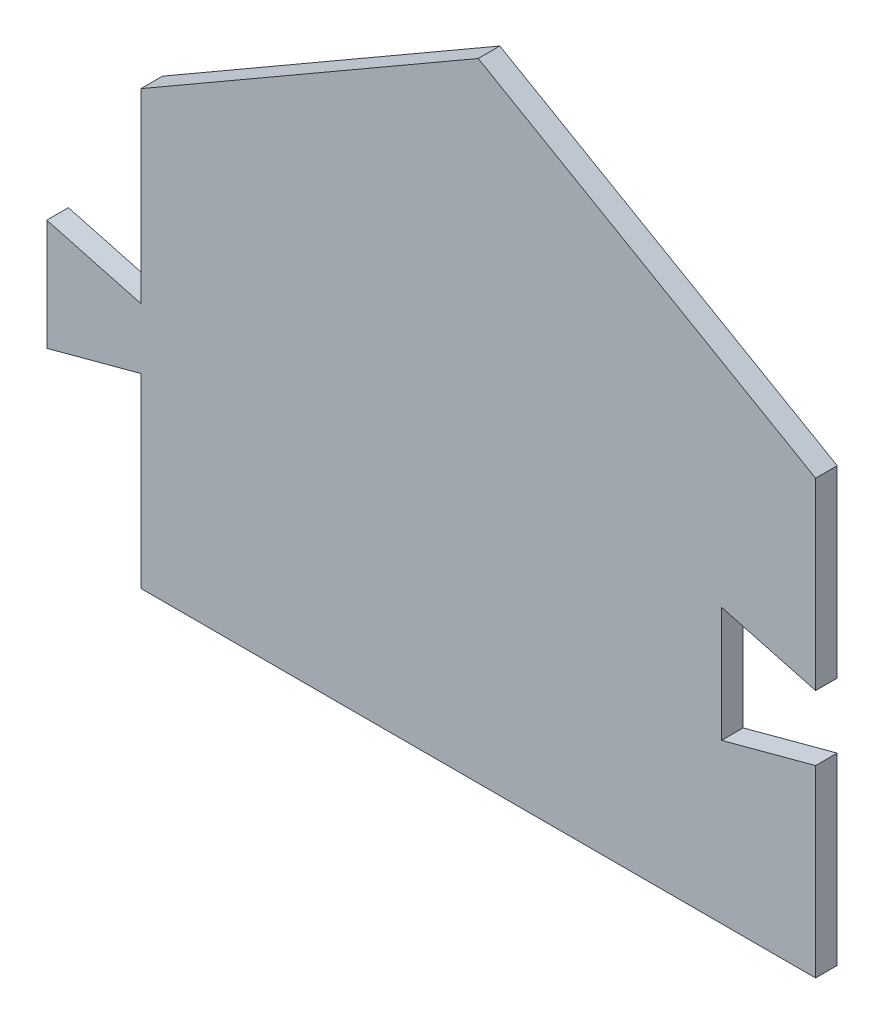
ISO-10303-21;
HEADER;
FILE_DESCRIPTION(('STEP AP214'),'2;1');
FILE_NAME('part.step','',(''),(''),'','','');
FILE_SCHEMA(('AUTOMOTIVE_DESIGN { 1 0 10303 214 1 1 1 1 }'));
ENDSEC;
DATA;
#1=APPLICATION_CONTEXT('core data for automotive mechanical design processes');
#2=APPLICATION_PROTOCOL_DEFINITION('international standard','automotive_design',2000,#1);
#3=PRODUCT_CONTEXT('',#1,'mechanical');
#4=PRODUCT('Part','Part','',(#3));
#5=PRODUCT_RELATED_PRODUCT_CATEGORY('part','',(#4));
#6=PRODUCT_DEFINITION_FORMATION('','',#4);
#7=PRODUCT_DEFINITION_CONTEXT('part definition',#1,'design');
#8=PRODUCT_DEFINITION('design','',#6,#7);
#9=PRODUCT_DEFINITION_SHAPE('','',#8);
#10=(LENGTH_UNIT() NAMED_UNIT(*) SI_UNIT(.MILLI.,.METRE.));
#11=(NAMED_UNIT(*) PLANE_ANGLE_UNIT() SI_UNIT($,.RADIAN.));
#12=(NAMED_UNIT(*) SI_UNIT($,.STERADIAN.) SOLID_ANGLE_UNIT());
#13=UNCERTAINTY_MEASURE_WITH_UNIT(LENGTH_MEASURE(1.E-05),#10,'distance_accuracy_value','');
#14=(GEOMETRIC_REPRESENTATION_CONTEXT(3) GLOBAL_UNCERTAINTY_ASSIGNED_CONTEXT((#13)) GLOBAL_UNIT_ASSIGNED_CONTEXT((#10,
#11,#12)) REPRESENTATION_CONTEXT('',''));
#15=CARTESIAN_POINT('',(0.,0.,0.));
#16=DIRECTION('',(0.,0.,1.));
#17=DIRECTION('',(1.,0.,0.));
#18=AXIS2_PLACEMENT_3D('',#15,#16,#17);
#19=CARTESIAN_POINT('',(0.,21.844,2.54));
#20=DIRECTION('',(1.,0.,0.));
#21=DIRECTION('',(0.,1.,0.));
#22=AXIS2_PLACEMENT_3D('',#19,#20,#21);
#23=PLANE('',#22);
#24=DIRECTION('',(0.,-1.,0.));
#25=VECTOR('',#24,1.);
#26=CARTESIAN_POINT('',(0.,21.844,0.));
#27=LINE('',#26,#25);
#28=CARTESIAN_POINT('',(0.,21.844,0.));
#29=VERTEX_POINT('',#28);
#30=CARTESIAN_POINT('',(0.,0.,0.));
#31=VERTEX_POINT('',#30);
#32=EDGE_CURVE('E163',#29,#31,#27,.T.);
#33=ORIENTED_EDGE('',*,*,#32,.T.);
#34=DIRECTION('',(0.,0.,-1.));
#35=VECTOR('',#34,1.);
#36=CARTESIAN_POINT('',(0.,0.,2.54));
#37=LINE('',#36,#35);
#38=CARTESIAN_POINT('',(0.,0.,2.54));
#39=VERTEX_POINT('',#38);
#40=EDGE_CURVE('E11',#39,#31,#37,.T.);
#41=ORIENTED_EDGE('',*,*,#40,.F.);
#42=DIRECTION('',(0.,-1.,0.));
#43=VECTOR('',#42,1.);
#44=CARTESIAN_POINT('',(0.,21.844,2.54));
#45=LINE('',#44,#43);
#46=CARTESIAN_POINT('',(0.,21.844,2.54));
#47=VERTEX_POINT('',#46);
#48=EDGE_CURVE('E187',#47,#39,#45,.T.);
#49=ORIENTED_EDGE('',*,*,#48,.F.);
#50=DIRECTION('',(0.,0.,-1.));
#51=VECTOR('',#50,1.);
#52=CARTESIAN_POINT('',(0.,21.844,2.54));
#53=LINE('',#52,#51);
#54=EDGE_CURVE('E159',#47,#29,#53,.T.);
#55=ORIENTED_EDGE('',*,*,#54,.T.);
#56=EDGE_LOOP('',(#33,#41,#49,#55));
#57=FACE_BOUND('',#56,.T.);
#58=ADVANCED_FACE('F37',(#57),#23,.F.);
#59=CARTESIAN_POINT('',(0.,0.,2.54));
#60=DIRECTION('',(0.,1.,0.));
#61=DIRECTION('',(0.,0.,1.));
#62=AXIS2_PLACEMENT_3D('',#59,#60,#61);
#63=PLANE('',#62);
#64=DIRECTION('',(1.,0.,0.));
#65=VECTOR('',#64,1.);
#66=CARTESIAN_POINT('',(0.,0.,0.));
#67=LINE('',#66,#65);
#68=CARTESIAN_POINT('',(79.1893629220493,0.,0.));
#69=VERTEX_POINT('',#68);
#70=EDGE_CURVE('E166',#31,#69,#67,.T.);
#71=ORIENTED_EDGE('',*,*,#70,.T.);
#72=DIRECTION('',(0.,0.,-1.));
#73=VECTOR('',#72,1.);
#74=CARTESIAN_POINT('',(79.1893629220493,0.,2.54));
#75=LINE('',#74,#73);
#76=CARTESIAN_POINT('',(79.1893629220493,0.,2.54));
#77=VERTEX_POINT('',#76);
#78=EDGE_CURVE('E45',#77,#69,#75,.T.);
#79=ORIENTED_EDGE('',*,*,#78,.F.);
#80=DIRECTION('',(1.,0.,0.));
#81=VECTOR('',#80,1.);
#82=CARTESIAN_POINT('',(0.,0.,2.54));
#83=LINE('',#82,#81);
#84=EDGE_CURVE('E111',#39,#77,#83,.T.);
#85=ORIENTED_EDGE('',*,*,#84,.F.);
#86=ORIENTED_EDGE('',*,*,#40,.T.);
#87=EDGE_LOOP('',(#71,#79,#85,#86));
#88=FACE_BOUND('',#87,.T.);
#89=ADVANCED_FACE('F270',(#88),#63,.F.);
#90=CARTESIAN_POINT('',(79.1893629220493,0.,2.54));
#91=DIRECTION('',(-1.,0.,0.));
#92=DIRECTION('',(0.,0.,1.));
#93=AXIS2_PLACEMENT_3D('',#90,#91,#92);
#94=PLANE('',#93);
#95=DIRECTION('',(0.,1.,0.));
#96=VECTOR('',#95,1.);
#97=CARTESIAN_POINT('',(79.1893629220493,0.,0.));
#98=LINE('',#97,#96);
#99=CARTESIAN_POINT('',(79.1893629220493,21.59,0.));
#100=VERTEX_POINT('',#99);
#101=EDGE_CURVE('E168',#69,#100,#98,.T.);
#102=ORIENTED_EDGE('',*,*,#101,.T.);
#103=DIRECTION('',(0.,0.,-1.));
#104=VECTOR('',#103,1.);
#105=CARTESIAN_POINT('',(79.1893629220493,21.59,2.54));
#106=LINE('',#105,#104);
#107=CARTESIAN_POINT('',(79.1893629220493,21.59,2.54));
#108=VERTEX_POINT('',#107);
#109=EDGE_CURVE('E209',#108,#100,#106,.T.);
#110=ORIENTED_EDGE('',*,*,#109,.F.);
#111=DIRECTION('',(0.,1.,0.));
#112=VECTOR('',#111,1.);
#113=CARTESIAN_POINT('',(79.1893629220493,0.,2.54));
#114=LINE('',#113,#112);
#115=EDGE_CURVE('E217',#77,#108,#114,.T.);
#116=ORIENTED_EDGE('',*,*,#115,.F.);
#117=ORIENTED_EDGE('',*,*,#78,.T.);
#118=EDGE_LOOP('',(#102,#110,#116,#117));
#119=FACE_BOUND('',#118,.T.);
#120=ADVANCED_FACE('F215',(#119),#94,.F.);
#121=CARTESIAN_POINT('',(79.1893629220493,21.59,2.54));
#122=DIRECTION('',(0.258819045102525,-0.965925826289067,0.));
#123=DIRECTION('',(0.965925826289067,0.258819045102525,0.));
#124=AXIS2_PLACEMENT_3D('',#121,#122,#123);
#125=PLANE('',#124);
#126=DIRECTION('',(-0.965925826289067,-0.258819045102525,0.));
#127=VECTOR('',#126,1.);
#128=CARTESIAN_POINT('',(79.1893629220493,21.59,0.));
#129=LINE('',#128,#127);
#130=CARTESIAN_POINT('',(68.1488307275653,18.6316983144781,0.));
#131=VERTEX_POINT('',#130);
#132=EDGE_CURVE('E170',#100,#131,#129,.T.);
#133=ORIENTED_EDGE('',*,*,#132,.T.);
#134=DIRECTION('',(0.,0.,-1.));
#135=VECTOR('',#134,1.);
#136=CARTESIAN_POINT('',(68.1488307275653,18.6316983144781,2.54));
#137=LINE('',#136,#135);
#138=CARTESIAN_POINT('',(68.1488307275653,18.6316983144781,2.54));
#139=VERTEX_POINT('',#138);
#140=EDGE_CURVE('E206',#139,#131,#137,.T.);
#141=ORIENTED_EDGE('',*,*,#140,.F.);
#142=DIRECTION('',(-0.965925826289067,-0.258819045102525,0.));
#143=VECTOR('',#142,1.);
#144=CARTESIAN_POINT('',(79.1893629220493,21.59,2.54));
#145=LINE('',#144,#143);
#146=EDGE_CURVE('E235',#108,#139,#145,.T.);
#147=ORIENTED_EDGE('',*,*,#146,.F.);
#148=ORIENTED_EDGE('',*,*,#109,.T.);
#149=EDGE_LOOP('',(#133,#141,#147,#148));
#150=FACE_BOUND('',#149,.T.);
#151=ADVANCED_FACE('F226',(#150),#125,.F.);
#152=CARTESIAN_POINT('',(68.1488307275653,18.6316983144781,2.54));
#153=DIRECTION('',(-1.,0.,0.));
#154=DIRECTION('',(0.,0.,1.));
#155=AXIS2_PLACEMENT_3D('',#152,#153,#154);
#156=PLANE('',#155);
#157=DIRECTION('',(0.,1.,0.));
#158=VECTOR('',#157,1.);
#159=CARTESIAN_POINT('',(68.1488307275653,18.6316983144781,0.));
#160=LINE('',#159,#158);
#161=CARTESIAN_POINT('',(68.1488307275653,32.1683016855219,0.));
#162=VERTEX_POINT('',#161);
#163=EDGE_CURVE('E172',#131,#162,#160,.T.);
#164=ORIENTED_EDGE('',*,*,#163,.T.);
#165=DIRECTION('',(0.,0.,-1.));
#166=VECTOR('',#165,1.);
#167=CARTESIAN_POINT('',(68.1488307275653,32.1683016855219,2.54));
#168=LINE('',#167,#166);
#169=CARTESIAN_POINT('',(68.1488307275653,32.1683016855219,2.54));
#170=VERTEX_POINT('',#169);
#171=EDGE_CURVE('E203',#170,#162,#168,.T.);
#172=ORIENTED_EDGE('',*,*,#171,.F.);
#173=DIRECTION('',(0.,1.,0.));
#174=VECTOR('',#173,1.);
#175=CARTESIAN_POINT('',(68.1488307275653,18.6316983144781,2.54));
#176=LINE('',#175,#174);
#177=EDGE_CURVE('E232',#139,#170,#176,.T.);
#178=ORIENTED_EDGE('',*,*,#177,.F.);
#179=ORIENTED_EDGE('',*,*,#140,.T.);
#180=EDGE_LOOP('',(#164,#172,#178,#179));
#181=FACE_BOUND('',#180,.T.);
#182=ADVANCED_FACE('F230',(#181),#156,.F.);
#183=CARTESIAN_POINT('',(68.1488307275653,32.1683016855219,2.54));
#184=DIRECTION('',(0.258819045102525,0.965925826289067,0.));
#185=DIRECTION('',(-0.965925826289067,0.258819045102525,0.));
#186=AXIS2_PLACEMENT_3D('',#183,#184,#185);
#187=PLANE('',#186);
#188=DIRECTION('',(0.965925826289067,-0.258819045102525,0.));
#189=VECTOR('',#188,1.);
#190=CARTESIAN_POINT('',(68.1488307275653,32.1683016855219,0.));
#191=LINE('',#190,#189);
#192=CARTESIAN_POINT('',(79.1893629220493,29.21,0.));
#193=VERTEX_POINT('',#192);
#194=EDGE_CURVE('E174',#162,#193,#191,.T.);
#195=ORIENTED_EDGE('',*,*,#194,.T.);
#196=DIRECTION('',(0.,0.,-1.));
#197=VECTOR('',#196,1.);
#198=CARTESIAN_POINT('',(79.1893629220493,29.21,2.54));
#199=LINE('',#198,#197);
#200=CARTESIAN_POINT('',(79.1893629220493,29.21,2.54));
#201=VERTEX_POINT('',#200);
#202=EDGE_CURVE('E200',#201,#193,#199,.T.);
#203=ORIENTED_EDGE('',*,*,#202,.F.);
#204=DIRECTION('',(0.965925826289067,-0.258819045102525,0.));
#205=VECTOR('',#204,1.);
#206=CARTESIAN_POINT('',(68.1488307275653,32.1683016855219,2.54));
#207=LINE('',#206,#205);
#208=EDGE_CURVE('E234',#170,#201,#207,.T.);
#209=ORIENTED_EDGE('',*,*,#208,.F.);
#210=ORIENTED_EDGE('',*,*,#171,.T.);
#211=EDGE_LOOP('',(#195,#203,#209,#210));
#212=FACE_BOUND('',#211,.T.);
#213=ADVANCED_FACE('F283',(#212),#187,.F.);
#214=CARTESIAN_POINT('',(79.1893629220493,29.21,2.54));
#215=DIRECTION('',(-1.,0.,0.));
#216=DIRECTION('',(0.,0.,1.));
#217=AXIS2_PLACEMENT_3D('',#214,#215,#216);
#218=PLANE('',#217);
#219=DIRECTION('',(0.,1.,0.));
#220=VECTOR('',#219,1.);
#221=CARTESIAN_POINT('',(79.1893629220493,29.21,0.));
#222=LINE('',#221,#220);
#223=CARTESIAN_POINT('',(79.1893629220493,50.8,0.));
#224=VERTEX_POINT('',#223);
#225=EDGE_CURVE('E176',#193,#224,#222,.T.);
#226=ORIENTED_EDGE('',*,*,#225,.T.);
#227=DIRECTION('',(0.,0.,-1.));
#228=VECTOR('',#227,1.);
#229=CARTESIAN_POINT('',(79.1893629220493,50.8,2.54));
#230=LINE('',#229,#228);
#231=CARTESIAN_POINT('',(79.1893629220493,50.8,2.54));
#232=VERTEX_POINT('',#231);
#233=EDGE_CURVE('E197',#232,#224,#230,.T.);
#234=ORIENTED_EDGE('',*,*,#233,.F.);
#235=DIRECTION('',(0.,1.,0.));
#236=VECTOR('',#235,1.);
#237=CARTESIAN_POINT('',(79.1893629220493,29.21,2.54));
#238=LINE('',#237,#236);
#239=EDGE_CURVE('E237',#201,#232,#238,.T.);
#240=ORIENTED_EDGE('',*,*,#239,.F.);
#241=ORIENTED_EDGE('',*,*,#202,.T.);
#242=EDGE_LOOP('',(#226,#234,#240,#241));
#243=FACE_BOUND('',#242,.T.);
#244=ADVANCED_FACE('F286',(#243),#218,.F.);
#245=CARTESIAN_POINT('',(79.1893629220493,50.8,2.54));
#246=DIRECTION('',(-0.499999999999995,-0.866025403784442,0.));
#247=DIRECTION('',(0.866025403784442,-0.499999999999995,0.));
#248=AXIS2_PLACEMENT_3D('',#245,#246,#247);
#249=PLANE('',#248);
#250=DIRECTION('',(-0.866025403784442,0.499999999999995,0.));
#251=VECTOR('',#250,1.);
#252=CARTESIAN_POINT('',(79.1893629220493,50.8,0.));
#253=LINE('',#252,#251);
#254=CARTESIAN_POINT('',(39.5946814610247,73.6599999999998,0.));
#255=VERTEX_POINT('',#254);
#256=EDGE_CURVE('E178',#224,#255,#253,.T.);
#257=ORIENTED_EDGE('',*,*,#256,.T.);
#258=DIRECTION('',(0.,0.,-1.));
#259=VECTOR('',#258,1.);
#260=CARTESIAN_POINT('',(39.5946814610247,73.6599999999998,2.54));
#261=LINE('',#260,#259);
#262=CARTESIAN_POINT('',(39.5946814610247,73.6599999999998,2.54));
#263=VERTEX_POINT('',#262);
#264=EDGE_CURVE('E194',#263,#255,#261,.T.);
#265=ORIENTED_EDGE('',*,*,#264,.F.);
#266=DIRECTION('',(-0.866025403784442,0.499999999999995,0.));
#267=VECTOR('',#266,1.);
#268=CARTESIAN_POINT('',(79.1893629220493,50.8,2.54));
#269=LINE('',#268,#267);
#270=EDGE_CURVE('E243',#232,#263,#269,.T.);
#271=ORIENTED_EDGE('',*,*,#270,.F.);
#272=ORIENTED_EDGE('',*,*,#233,.T.);
#273=EDGE_LOOP('',(#257,#265,#271,#272));
#274=FACE_BOUND('',#273,.T.);
#275=ADVANCED_FACE('F290',(#274),#249,.F.);
#276=CARTESIAN_POINT('',(39.5946814610247,73.6599999999998,2.54));
#277=DIRECTION('',(0.499999999999995,-0.866025403784442,0.));
#278=DIRECTION('',(0.866025403784442,0.499999999999995,0.));
#279=AXIS2_PLACEMENT_3D('',#276,#277,#278);
#280=PLANE('',#279);
#281=DIRECTION('',(-0.866025403784442,-0.499999999999995,0.));
#282=VECTOR('',#281,1.);
#283=CARTESIAN_POINT('',(39.5946814610247,73.6599999999998,0.));
#284=LINE('',#283,#282);
#285=CARTESIAN_POINT('',(0.,50.8,0.));
#286=VERTEX_POINT('',#285);
#287=EDGE_CURVE('E180',#255,#286,#284,.T.);
#288=ORIENTED_EDGE('',*,*,#287,.T.);
#289=DIRECTION('',(0.,0.,-1.));
#290=VECTOR('',#289,1.);
#291=CARTESIAN_POINT('',(0.,50.8,2.54));
#292=LINE('',#291,#290);
#293=CARTESIAN_POINT('',(0.,50.8,2.54));
#294=VERTEX_POINT('',#293);
#295=EDGE_CURVE('E191',#294,#286,#292,.T.);
#296=ORIENTED_EDGE('',*,*,#295,.F.);
#297=DIRECTION('',(-0.866025403784442,-0.499999999999995,0.));
#298=VECTOR('',#297,1.);
#299=CARTESIAN_POINT('',(39.5946814610247,73.6599999999998,2.54));
#300=LINE('',#299,#298);
#301=EDGE_CURVE('E245',#263,#294,#300,.T.);
#302=ORIENTED_EDGE('',*,*,#301,.F.);
#303=ORIENTED_EDGE('',*,*,#264,.T.);
#304=EDGE_LOOP('',(#288,#296,#302,#303));
#305=FACE_BOUND('',#304,.T.);
#306=ADVANCED_FACE('F251',(#305),#280,.F.);
#307=CARTESIAN_POINT('',(0.,50.8,2.54));
#308=DIRECTION('',(1.,0.,0.));
#309=DIRECTION('',(0.,1.,0.));
#310=AXIS2_PLACEMENT_3D('',#307,#308,#309);
#311=PLANE('',#310);
#312=DIRECTION('',(0.,-1.,0.));
#313=VECTOR('',#312,1.);
#314=CARTESIAN_POINT('',(0.,50.8,0.));
#315=LINE('',#314,#313);
#316=CARTESIAN_POINT('',(0.,28.956,0.));
#317=VERTEX_POINT('',#316);
#318=EDGE_CURVE('E182',#286,#317,#315,.T.);
#319=ORIENTED_EDGE('',*,*,#318,.T.);
#320=DIRECTION('',(0.,0.,-1.));
#321=VECTOR('',#320,1.);
#322=CARTESIAN_POINT('',(0.,28.956,2.54));
#323=LINE('',#322,#321);
#324=CARTESIAN_POINT('',(0.,28.956,2.54));
#325=VERTEX_POINT('',#324);
#326=EDGE_CURVE('E154',#325,#317,#323,.T.);
#327=ORIENTED_EDGE('',*,*,#326,.F.);
#328=DIRECTION('',(0.,-1.,0.));
#329=VECTOR('',#328,1.);
#330=CARTESIAN_POINT('',(0.,50.8,2.54));
#331=LINE('',#330,#329);
#332=EDGE_CURVE('E145',#294,#325,#331,.T.);
#333=ORIENTED_EDGE('',*,*,#332,.F.);
#334=ORIENTED_EDGE('',*,*,#295,.T.);
#335=EDGE_LOOP('',(#319,#327,#333,#334));
#336=FACE_BOUND('',#335,.T.);
#337=ADVANCED_FACE('F255',(#336),#311,.F.);
#338=CARTESIAN_POINT('',(0.,28.956,2.54));
#339=DIRECTION('',(-0.258819045102525,-0.965925826289067,0.));
#340=DIRECTION('',(0.965925826289067,-0.258819045102525,0.));
#341=AXIS2_PLACEMENT_3D('',#338,#339,#340);
#342=PLANE('',#341);
#343=DIRECTION('',(-0.965925826289067,0.258819045102525,0.));
#344=VECTOR('',#343,1.);
#345=CARTESIAN_POINT('',(0.,28.956,0.));
#346=LINE('',#345,#344);
#347=CARTESIAN_POINT('',(-11.040532194484,31.9143016855219,0.));
#348=VERTEX_POINT('',#347);
#349=EDGE_CURVE('E153',#317,#348,#346,.T.);
#350=ORIENTED_EDGE('',*,*,#349,.T.);
#351=DIRECTION('',(0.,0.,-1.));
#352=VECTOR('',#351,1.);
#353=CARTESIAN_POINT('',(-11.040532194484,31.9143016855219,2.54));
#354=LINE('',#353,#352);
#355=CARTESIAN_POINT('',(-11.040532194484,31.9143016855219,2.54));
#356=VERTEX_POINT('',#355);
#357=EDGE_CURVE('E150',#356,#348,#354,.T.);
#358=ORIENTED_EDGE('',*,*,#357,.F.);
#359=DIRECTION('',(-0.965925826289067,0.258819045102525,0.));
#360=VECTOR('',#359,1.);
#361=CARTESIAN_POINT('',(0.,28.956,2.54));
#362=LINE('',#361,#360);
#363=EDGE_CURVE('E139',#325,#356,#362,.T.);
#364=ORIENTED_EDGE('',*,*,#363,.F.);
#365=ORIENTED_EDGE('',*,*,#326,.T.);
#366=EDGE_LOOP('',(#350,#358,#364,#365));
#367=FACE_BOUND('',#366,.T.);
#368=ADVANCED_FACE('F151',(#367),#342,.F.);
#369=CARTESIAN_POINT('',(-11.040532194484,31.9143016855219,2.54));
#370=DIRECTION('',(1.,0.,0.));
#371=DIRECTION('',(0.,1.,0.));
#372=AXIS2_PLACEMENT_3D('',#369,#370,#371);
#373=PLANE('',#372);
#374=DIRECTION('',(0.,-1.,0.));
#375=VECTOR('',#374,1.);
#376=CARTESIAN_POINT('',(-11.040532194484,31.9143016855219,0.));
#377=LINE('',#376,#375);
#378=CARTESIAN_POINT('',(-11.040532194484,18.8856983144781,0.));
#379=VERTEX_POINT('',#378);
#380=EDGE_CURVE('E97',#348,#379,#377,.T.);
#381=ORIENTED_EDGE('',*,*,#380,.T.);
#382=DIRECTION('',(0.,0.,-1.));
#383=VECTOR('',#382,1.);
#384=CARTESIAN_POINT('',(-11.040532194484,18.8856983144781,2.54));
#385=LINE('',#384,#383);
#386=CARTESIAN_POINT('',(-11.040532194484,18.8856983144781,2.54));
#387=VERTEX_POINT('',#386);
#388=EDGE_CURVE('E155',#387,#379,#385,.T.);
#389=ORIENTED_EDGE('',*,*,#388,.F.);
#390=DIRECTION('',(0.,-1.,0.));
#391=VECTOR('',#390,1.);
#392=CARTESIAN_POINT('',(-11.040532194484,31.9143016855219,2.54));
#393=LINE('',#392,#391);
#394=EDGE_CURVE('E143',#356,#387,#393,.T.);
#395=ORIENTED_EDGE('',*,*,#394,.F.);
#396=ORIENTED_EDGE('',*,*,#357,.T.);
#397=EDGE_LOOP('',(#381,#389,#395,#396));
#398=FACE_BOUND('',#397,.T.);
#399=ADVANCED_FACE('F157',(#398),#373,.F.);
#400=CARTESIAN_POINT('',(-11.040532194484,18.8856983144781,2.54));
#401=DIRECTION('',(-0.258819045102525,0.965925826289067,0.));
#402=DIRECTION('',(-0.965925826289067,-0.258819045102526,0.));
#403=AXIS2_PLACEMENT_3D('',#400,#401,#402);
#404=PLANE('',#403);
#405=DIRECTION('',(0.965925826289067,0.258819045102525,0.));
#406=VECTOR('',#405,1.);
#407=CARTESIAN_POINT('',(-11.040532194484,18.8856983144781,0.));
#408=LINE('',#407,#406);
#409=EDGE_CURVE('E103',#379,#29,#408,.T.);
#410=ORIENTED_EDGE('',*,*,#409,.T.);
#411=ORIENTED_EDGE('',*,*,#54,.F.);
#412=DIRECTION('',(0.965925826289067,0.258819045102525,0.));
#413=VECTOR('',#412,1.);
#414=CARTESIAN_POINT('',(-11.040532194484,18.8856983144781,2.54));
#415=LINE('',#414,#413);
#416=EDGE_CURVE('E53',#387,#47,#415,.T.);
#417=ORIENTED_EDGE('',*,*,#416,.F.);
#418=ORIENTED_EDGE('',*,*,#388,.T.);
#419=EDGE_LOOP('',(#410,#411,#417,#418));
#420=FACE_BOUND('',#419,.T.);
#421=ADVANCED_FACE('F259',(#420),#404,.F.);
#422=CARTESIAN_POINT('',(0.,0.,2.54));
#423=DIRECTION('',(0.,0.,1.));
#424=DIRECTION('',(1.,0.,0.));
#425=AXIS2_PLACEMENT_3D('',#422,#423,#424);
#426=PLANE('',#425);
#427=ORIENTED_EDGE('',*,*,#48,.T.);
#428=ORIENTED_EDGE('',*,*,#84,.T.);
#429=ORIENTED_EDGE('',*,*,#115,.T.);
#430=ORIENTED_EDGE('',*,*,#146,.T.);
#431=ORIENTED_EDGE('',*,*,#177,.T.);
#432=ORIENTED_EDGE('',*,*,#208,.T.);
#433=ORIENTED_EDGE('',*,*,#239,.T.);
#434=ORIENTED_EDGE('',*,*,#270,.T.);
#435=ORIENTED_EDGE('',*,*,#301,.T.);
#436=ORIENTED_EDGE('',*,*,#332,.T.);
#437=ORIENTED_EDGE('',*,*,#363,.T.);
#438=ORIENTED_EDGE('',*,*,#394,.T.);
#439=ORIENTED_EDGE('',*,*,#416,.T.);
#440=EDGE_LOOP('',(#427,#428,#429,#430,#431,#432,#433,#434,#435,#436,#437,#438,#439));
#441=FACE_BOUND('',#440,.T.);
#442=ADVANCED_FACE('F141',(#441),#426,.T.);
#443=CARTESIAN_POINT('',(0.,0.,0.));
#444=DIRECTION('',(0.,0.,1.));
#445=DIRECTION('',(1.,0.,0.));
#446=AXIS2_PLACEMENT_3D('',#443,#444,#445);
#447=PLANE('',#446);
#448=ORIENTED_EDGE('',*,*,#32,.F.);
#449=ORIENTED_EDGE('',*,*,#409,.F.);
#450=ORIENTED_EDGE('',*,*,#380,.F.);
#451=ORIENTED_EDGE('',*,*,#349,.F.);
#452=ORIENTED_EDGE('',*,*,#318,.F.);
#453=ORIENTED_EDGE('',*,*,#287,.F.);
#454=ORIENTED_EDGE('',*,*,#256,.F.);
#455=ORIENTED_EDGE('',*,*,#225,.F.);
#456=ORIENTED_EDGE('',*,*,#194,.F.);
#457=ORIENTED_EDGE('',*,*,#163,.F.);
#458=ORIENTED_EDGE('',*,*,#132,.F.);
#459=ORIENTED_EDGE('',*,*,#101,.F.);
#460=ORIENTED_EDGE('',*,*,#70,.F.);
#461=EDGE_LOOP('',(#448,#449,#450,#451,#452,#453,#454,#455,#456,#457,#458,#459,#460));
#462=FACE_BOUND('',#461,.T.);
#463=ADVANCED_FACE('F221',(#462),#447,.F.);
#464=CLOSED_SHELL('',(#58,#89,#120,#151,#182,#213,#244,#275,#306,#337,#368,#399,#421,#442,#463));
#465=MANIFOLD_SOLID_BREP('B2',#464);
#466=ADVANCED_BREP_SHAPE_REPRESENTATION('',(#18,#465),#14);
#467=SHAPE_DEFINITION_REPRESENTATION(#9,#466);
ENDSEC;
END-ISO-10303-21;
